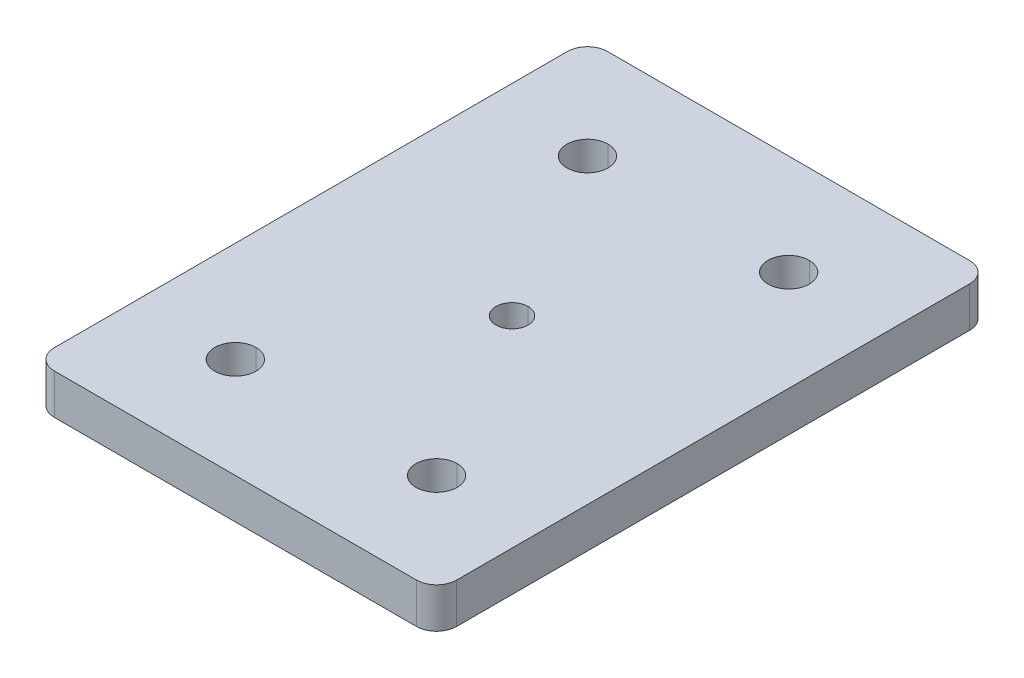
ISO-10303-21;
HEADER;
FILE_DESCRIPTION(('STEP AP214'),'2;1');
FILE_NAME('part.step','',(''),(''),'','','');
FILE_SCHEMA(('AUTOMOTIVE_DESIGN { 1 0 10303 214 1 1 1 1 }'));
ENDSEC;
DATA;
#1=APPLICATION_CONTEXT('core data for automotive mechanical design processes');
#2=APPLICATION_PROTOCOL_DEFINITION('international standard','automotive_design',2000,#1);
#3=PRODUCT_CONTEXT('',#1,'mechanical');
#4=PRODUCT('Part','Part','',(#3));
#5=PRODUCT_RELATED_PRODUCT_CATEGORY('part','',(#4));
#6=PRODUCT_DEFINITION_FORMATION('','',#4);
#7=PRODUCT_DEFINITION_CONTEXT('part definition',#1,'design');
#8=PRODUCT_DEFINITION('design','',#6,#7);
#9=PRODUCT_DEFINITION_SHAPE('','',#8);
#10=(LENGTH_UNIT() NAMED_UNIT(*) SI_UNIT(.MILLI.,.METRE.));
#11=(NAMED_UNIT(*) PLANE_ANGLE_UNIT() SI_UNIT($,.RADIAN.));
#12=(NAMED_UNIT(*) SI_UNIT($,.STERADIAN.) SOLID_ANGLE_UNIT());
#13=UNCERTAINTY_MEASURE_WITH_UNIT(LENGTH_MEASURE(1.E-05),#10,'distance_accuracy_value','');
#14=(GEOMETRIC_REPRESENTATION_CONTEXT(3) GLOBAL_UNCERTAINTY_ASSIGNED_CONTEXT((#13)) GLOBAL_UNIT_ASSIGNED_CONTEXT((#10,
#11,#12)) REPRESENTATION_CONTEXT('',''));
#15=CARTESIAN_POINT('',(0.,0.,0.));
#16=DIRECTION('',(0.,0.,1.));
#17=DIRECTION('',(1.,0.,0.));
#18=AXIS2_PLACEMENT_3D('',#15,#16,#17);
#19=CARTESIAN_POINT('',(18.,4.,25.5));
#20=DIRECTION('',(0.,-1.,0.));
#21=DIRECTION('',(0.,0.,-1.));
#22=AXIS2_PLACEMENT_3D('',#19,#20,#21);
#23=CYLINDRICAL_SURFACE('',#22,2.);
#24=CARTESIAN_POINT('',(18.,4.,25.5));
#25=DIRECTION('',(0.,1.,0.));
#26=DIRECTION('',(0.,0.,-1.));
#27=AXIS2_PLACEMENT_3D('',#24,#25,#26);
#28=CIRCLE('',#27,2.);
#29=CARTESIAN_POINT('',(18.,4.,27.5));
#30=VERTEX_POINT('',#29);
#31=CARTESIAN_POINT('',(20.,4.,25.5));
#32=VERTEX_POINT('',#31);
#33=EDGE_CURVE('E329',#30,#32,#28,.T.);
#34=ORIENTED_EDGE('',*,*,#33,.F.);
#35=DIRECTION('',(0.,1.,0.));
#36=VECTOR('',#35,1.);
#37=CARTESIAN_POINT('',(18.,4.,27.5));
#38=LINE('',#37,#36);
#39=CARTESIAN_POINT('',(18.,0.,27.5));
#40=VERTEX_POINT('',#39);
#41=EDGE_CURVE('E51',#40,#30,#38,.T.);
#42=ORIENTED_EDGE('',*,*,#41,.F.);
#43=CARTESIAN_POINT('',(18.,0.,25.5));
#44=DIRECTION('',(0.,-1.,0.));
#45=DIRECTION('',(0.,0.,-1.));
#46=AXIS2_PLACEMENT_3D('',#43,#44,#45);
#47=CIRCLE('',#46,2.);
#48=CARTESIAN_POINT('',(20.,0.,25.5));
#49=VERTEX_POINT('',#48);
#50=EDGE_CURVE('E300',#49,#40,#47,.T.);
#51=ORIENTED_EDGE('',*,*,#50,.F.);
#52=DIRECTION('',(0.,-1.,0.));
#53=VECTOR('',#52,1.);
#54=CARTESIAN_POINT('',(20.,4.,25.5));
#55=LINE('',#54,#53);
#56=EDGE_CURVE('E225',#32,#49,#55,.T.);
#57=ORIENTED_EDGE('',*,*,#56,.F.);
#58=EDGE_LOOP('',(#34,#42,#51,#57));
#59=FACE_BOUND('',#58,.T.);
#60=ADVANCED_FACE('F18',(#59),#23,.T.);
#61=CARTESIAN_POINT('',(-18.,4.,25.5));
#62=DIRECTION('',(0.,-1.,0.));
#63=DIRECTION('',(0.,0.,-1.));
#64=AXIS2_PLACEMENT_3D('',#61,#62,#63);
#65=CYLINDRICAL_SURFACE('',#64,2.);
#66=CARTESIAN_POINT('',(-18.,4.,25.5));
#67=DIRECTION('',(0.,1.,0.));
#68=DIRECTION('',(0.,0.,-1.));
#69=AXIS2_PLACEMENT_3D('',#66,#67,#68);
#70=CIRCLE('',#69,2.);
#71=CARTESIAN_POINT('',(-20.,4.,25.5));
#72=VERTEX_POINT('',#71);
#73=CARTESIAN_POINT('',(-18.,4.,27.5));
#74=VERTEX_POINT('',#73);
#75=EDGE_CURVE('E316',#72,#74,#70,.T.);
#76=ORIENTED_EDGE('',*,*,#75,.F.);
#77=DIRECTION('',(0.,1.,0.));
#78=VECTOR('',#77,1.);
#79=CARTESIAN_POINT('',(-20.,4.,25.5));
#80=LINE('',#79,#78);
#81=CARTESIAN_POINT('',(-20.,0.,25.5));
#82=VERTEX_POINT('',#81);
#83=EDGE_CURVE('E379',#82,#72,#80,.T.);
#84=ORIENTED_EDGE('',*,*,#83,.F.);
#85=CARTESIAN_POINT('',(-18.,0.,25.5));
#86=DIRECTION('',(0.,-1.,0.));
#87=DIRECTION('',(0.,0.,-1.));
#88=AXIS2_PLACEMENT_3D('',#85,#86,#87);
#89=CIRCLE('',#88,2.);
#90=CARTESIAN_POINT('',(-18.,0.,27.5));
#91=VERTEX_POINT('',#90);
#92=EDGE_CURVE('E321',#91,#82,#89,.T.);
#93=ORIENTED_EDGE('',*,*,#92,.F.);
#94=DIRECTION('',(0.,-1.,0.));
#95=VECTOR('',#94,1.);
#96=CARTESIAN_POINT('',(-18.,4.,27.5));
#97=LINE('',#96,#95);
#98=EDGE_CURVE('E40',#74,#91,#97,.T.);
#99=ORIENTED_EDGE('',*,*,#98,.F.);
#100=EDGE_LOOP('',(#76,#84,#93,#99));
#101=FACE_BOUND('',#100,.T.);
#102=ADVANCED_FACE('F20',(#101),#65,.T.);
#103=CARTESIAN_POINT('',(18.,4.,-25.5));
#104=DIRECTION('',(0.,-1.,0.));
#105=DIRECTION('',(0.,0.,-1.));
#106=AXIS2_PLACEMENT_3D('',#103,#104,#105);
#107=CYLINDRICAL_SURFACE('',#106,2.);
#108=CARTESIAN_POINT('',(18.,4.,-25.5));
#109=DIRECTION('',(0.,1.,0.));
#110=DIRECTION('',(0.,0.,-1.));
#111=AXIS2_PLACEMENT_3D('',#108,#109,#110);
#112=CIRCLE('',#111,2.);
#113=CARTESIAN_POINT('',(20.,4.,-25.5));
#114=VERTEX_POINT('',#113);
#115=CARTESIAN_POINT('',(18.,4.,-27.5));
#116=VERTEX_POINT('',#115);
#117=EDGE_CURVE('E337',#114,#116,#112,.T.);
#118=ORIENTED_EDGE('',*,*,#117,.F.);
#119=DIRECTION('',(0.,1.,0.));
#120=VECTOR('',#119,1.);
#121=CARTESIAN_POINT('',(20.,4.,-25.5));
#122=LINE('',#121,#120);
#123=CARTESIAN_POINT('',(20.,0.,-25.5));
#124=VERTEX_POINT('',#123);
#125=EDGE_CURVE('E223',#124,#114,#122,.T.);
#126=ORIENTED_EDGE('',*,*,#125,.F.);
#127=CARTESIAN_POINT('',(18.,0.,-25.5));
#128=DIRECTION('',(0.,-1.,0.));
#129=DIRECTION('',(0.,0.,-1.));
#130=AXIS2_PLACEMENT_3D('',#127,#128,#129);
#131=CIRCLE('',#130,2.);
#132=CARTESIAN_POINT('',(18.,0.,-27.5));
#133=VERTEX_POINT('',#132);
#134=EDGE_CURVE('E257',#133,#124,#131,.T.);
#135=ORIENTED_EDGE('',*,*,#134,.F.);
#136=DIRECTION('',(0.,-1.,0.));
#137=VECTOR('',#136,1.);
#138=CARTESIAN_POINT('',(18.,4.,-27.5));
#139=LINE('',#138,#137);
#140=EDGE_CURVE('E11',#116,#133,#139,.T.);
#141=ORIENTED_EDGE('',*,*,#140,.F.);
#142=EDGE_LOOP('',(#118,#126,#135,#141));
#143=FACE_BOUND('',#142,.T.);
#144=ADVANCED_FACE('F828',(#143),#107,.T.);
#145=CARTESIAN_POINT('',(-18.,4.,-25.5));
#146=DIRECTION('',(0.,-1.,0.));
#147=DIRECTION('',(0.,0.,-1.));
#148=AXIS2_PLACEMENT_3D('',#145,#146,#147);
#149=CYLINDRICAL_SURFACE('',#148,2.);
#150=CARTESIAN_POINT('',(-18.,4.,-25.5));
#151=DIRECTION('',(0.,1.,0.));
#152=DIRECTION('',(0.,0.,-1.));
#153=AXIS2_PLACEMENT_3D('',#150,#151,#152);
#154=CIRCLE('',#153,2.);
#155=CARTESIAN_POINT('',(-18.,4.,-27.5));
#156=VERTEX_POINT('',#155);
#157=CARTESIAN_POINT('',(-20.,4.,-25.5));
#158=VERTEX_POINT('',#157);
#159=EDGE_CURVE('E308',#156,#158,#154,.T.);
#160=ORIENTED_EDGE('',*,*,#159,.F.);
#161=DIRECTION('',(0.,1.,0.));
#162=VECTOR('',#161,1.);
#163=CARTESIAN_POINT('',(-18.,4.,-27.5));
#164=LINE('',#163,#162);
#165=CARTESIAN_POINT('',(-18.,0.,-27.5));
#166=VERTEX_POINT('',#165);
#167=EDGE_CURVE('E27',#166,#156,#164,.T.);
#168=ORIENTED_EDGE('',*,*,#167,.F.);
#169=CARTESIAN_POINT('',(-18.,0.,-25.5));
#170=DIRECTION('',(0.,-1.,0.));
#171=DIRECTION('',(0.,0.,-1.));
#172=AXIS2_PLACEMENT_3D('',#169,#170,#171);
#173=CIRCLE('',#172,2.);
#174=CARTESIAN_POINT('',(-20.,0.,-25.5));
#175=VERTEX_POINT('',#174);
#176=EDGE_CURVE('E355',#175,#166,#173,.T.);
#177=ORIENTED_EDGE('',*,*,#176,.F.);
#178=DIRECTION('',(0.,-1.,0.));
#179=VECTOR('',#178,1.);
#180=CARTESIAN_POINT('',(-20.,4.,-25.5));
#181=LINE('',#180,#179);
#182=EDGE_CURVE('E376',#158,#175,#181,.T.);
#183=ORIENTED_EDGE('',*,*,#182,.F.);
#184=EDGE_LOOP('',(#160,#168,#177,#183));
#185=FACE_BOUND('',#184,.T.);
#186=ADVANCED_FACE('F398',(#185),#149,.T.);
#187=CARTESIAN_POINT('',(-9.99999999999964,4.,17.5));
#188=DIRECTION('',(0.,-1.,0.));
#189=DIRECTION('',(0.,0.,-1.));
#190=AXIS2_PLACEMENT_3D('',#187,#188,#189);
#191=CYLINDRICAL_SURFACE('',#190,2.05);
#192=DIRECTION('',(0.,-1.,0.));
#193=VECTOR('',#192,1.);
#194=CARTESIAN_POINT('',(-9.99999999999964,4.,19.55));
#195=LINE('',#194,#193);
#196=CARTESIAN_POINT('',(-9.99999999999964,4.,19.55));
#197=VERTEX_POINT('',#196);
#198=CARTESIAN_POINT('',(-9.99999999999964,0.,19.55));
#199=VERTEX_POINT('',#198);
#200=EDGE_CURVE('E195',#197,#199,#195,.T.);
#201=ORIENTED_EDGE('',*,*,#200,.F.);
#202=CARTESIAN_POINT('',(-9.99999999999964,4.,17.5));
#203=DIRECTION('',(0.,1.,0.));
#204=DIRECTION('',(0.,0.,1.));
#205=AXIS2_PLACEMENT_3D('',#202,#203,#204);
#206=CIRCLE('',#205,2.05);
#207=CARTESIAN_POINT('',(-9.99999999999964,4.,15.45));
#208=VERTEX_POINT('',#207);
#209=EDGE_CURVE('E189',#197,#208,#206,.T.);
#210=ORIENTED_EDGE('',*,*,#209,.T.);
#211=DIRECTION('',(0.,-1.,0.));
#212=VECTOR('',#211,1.);
#213=CARTESIAN_POINT('',(-9.99999999999964,4.,15.45));
#214=LINE('',#213,#212);
#215=CARTESIAN_POINT('',(-9.99999999999964,0.,15.45));
#216=VERTEX_POINT('',#215);
#217=EDGE_CURVE('E192',#208,#216,#214,.T.);
#218=ORIENTED_EDGE('',*,*,#217,.T.);
#219=CARTESIAN_POINT('',(-9.99999999999964,0.,17.5));
#220=DIRECTION('',(0.,1.,0.));
#221=DIRECTION('',(0.,0.,1.));
#222=AXIS2_PLACEMENT_3D('',#219,#220,#221);
#223=CIRCLE('',#222,2.05);
#224=EDGE_CURVE('E373',#199,#216,#223,.T.);
#225=ORIENTED_EDGE('',*,*,#224,.F.);
#226=EDGE_LOOP('',(#201,#210,#218,#225));
#227=FACE_BOUND('',#226,.T.);
#228=ADVANCED_FACE('F191',(#227),#191,.F.);
#229=CARTESIAN_POINT('',(10.0000000000004,4.,17.5));
#230=DIRECTION('',(0.,-1.,0.));
#231=DIRECTION('',(0.,0.,-1.));
#232=AXIS2_PLACEMENT_3D('',#229,#230,#231);
#233=CYLINDRICAL_SURFACE('',#232,2.05);
#234=DIRECTION('',(0.,-1.,0.));
#235=VECTOR('',#234,1.);
#236=CARTESIAN_POINT('',(10.0000000000004,4.,19.55));
#237=LINE('',#236,#235);
#238=CARTESIAN_POINT('',(10.0000000000004,4.,19.55));
#239=VERTEX_POINT('',#238);
#240=CARTESIAN_POINT('',(10.0000000000004,0.,19.55));
#241=VERTEX_POINT('',#240);
#242=EDGE_CURVE('E244',#239,#241,#237,.T.);
#243=ORIENTED_EDGE('',*,*,#242,.F.);
#244=CARTESIAN_POINT('',(10.0000000000004,4.,17.5));
#245=DIRECTION('',(0.,1.,0.));
#246=DIRECTION('',(0.,0.,1.));
#247=AXIS2_PLACEMENT_3D('',#244,#245,#246);
#248=CIRCLE('',#247,2.05);
#249=CARTESIAN_POINT('',(10.0000000000004,4.,15.45));
#250=VERTEX_POINT('',#249);
#251=EDGE_CURVE('E201',#239,#250,#248,.T.);
#252=ORIENTED_EDGE('',*,*,#251,.T.);
#253=DIRECTION('',(0.,-1.,0.));
#254=VECTOR('',#253,1.);
#255=CARTESIAN_POINT('',(10.0000000000004,4.,15.45));
#256=LINE('',#255,#254);
#257=CARTESIAN_POINT('',(10.0000000000004,0.,15.45));
#258=VERTEX_POINT('',#257);
#259=EDGE_CURVE('E249',#250,#258,#256,.T.);
#260=ORIENTED_EDGE('',*,*,#259,.T.);
#261=CARTESIAN_POINT('',(10.0000000000004,0.,17.5));
#262=DIRECTION('',(0.,1.,0.));
#263=DIRECTION('',(0.,0.,1.));
#264=AXIS2_PLACEMENT_3D('',#261,#262,#263);
#265=CIRCLE('',#264,2.05);
#266=EDGE_CURVE('E325',#241,#258,#265,.T.);
#267=ORIENTED_EDGE('',*,*,#266,.F.);
#268=EDGE_LOOP('',(#243,#252,#260,#267));
#269=FACE_BOUND('',#268,.T.);
#270=ADVANCED_FACE('F739',(#269),#233,.F.);
#271=CARTESIAN_POINT('',(10.,4.,-17.5));
#272=DIRECTION('',(0.,-1.,0.));
#273=DIRECTION('',(0.,0.,-1.));
#274=AXIS2_PLACEMENT_3D('',#271,#272,#273);
#275=CYLINDRICAL_SURFACE('',#274,2.05);
#276=DIRECTION('',(0.,-1.,0.));
#277=VECTOR('',#276,1.);
#278=CARTESIAN_POINT('',(10.,4.,-15.45));
#279=LINE('',#278,#277);
#280=CARTESIAN_POINT('',(10.,4.,-15.45));
#281=VERTEX_POINT('',#280);
#282=CARTESIAN_POINT('',(10.,0.,-15.45));
#283=VERTEX_POINT('',#282);
#284=EDGE_CURVE('E266',#281,#283,#279,.T.);
#285=ORIENTED_EDGE('',*,*,#284,.F.);
#286=CARTESIAN_POINT('',(10.,4.,-17.5));
#287=DIRECTION('',(0.,1.,0.));
#288=DIRECTION('',(0.,0.,1.));
#289=AXIS2_PLACEMENT_3D('',#286,#287,#288);
#290=CIRCLE('',#289,2.05);
#291=CARTESIAN_POINT('',(10.,4.,-19.55));
#292=VERTEX_POINT('',#291);
#293=EDGE_CURVE('E347',#281,#292,#290,.T.);
#294=ORIENTED_EDGE('',*,*,#293,.T.);
#295=DIRECTION('',(0.,-1.,0.));
#296=VECTOR('',#295,1.);
#297=CARTESIAN_POINT('',(10.,4.,-19.55));
#298=LINE('',#297,#296);
#299=CARTESIAN_POINT('',(10.,0.,-19.55));
#300=VERTEX_POINT('',#299);
#301=EDGE_CURVE('E279',#292,#300,#298,.T.);
#302=ORIENTED_EDGE('',*,*,#301,.T.);
#303=CARTESIAN_POINT('',(10.,0.,-17.5));
#304=DIRECTION('',(0.,1.,0.));
#305=DIRECTION('',(0.,0.,1.));
#306=AXIS2_PLACEMENT_3D('',#303,#304,#305);
#307=CIRCLE('',#306,2.05);
#308=EDGE_CURVE('E289',#283,#300,#307,.T.);
#309=ORIENTED_EDGE('',*,*,#308,.F.);
#310=EDGE_LOOP('',(#285,#294,#302,#309));
#311=FACE_BOUND('',#310,.T.);
#312=ADVANCED_FACE('F707',(#311),#275,.F.);
#313=CARTESIAN_POINT('',(0.,4.,0.));
#314=DIRECTION('',(0.,-1.,0.));
#315=DIRECTION('',(0.,0.,-1.));
#316=AXIS2_PLACEMENT_3D('',#313,#314,#315);
#317=CYLINDRICAL_SURFACE('',#316,1.6);
#318=DIRECTION('',(0.,-1.,0.));
#319=VECTOR('',#318,1.);
#320=CARTESIAN_POINT('',(0.,4.,1.6));
#321=LINE('',#320,#319);
#322=CARTESIAN_POINT('',(0.,4.,1.6));
#323=VERTEX_POINT('',#322);
#324=CARTESIAN_POINT('',(0.,0.,1.6));
#325=VERTEX_POINT('',#324);
#326=EDGE_CURVE('E253',#323,#325,#321,.T.);
#327=ORIENTED_EDGE('',*,*,#326,.F.);
#328=CARTESIAN_POINT('',(0.,4.,0.));
#329=DIRECTION('',(0.,1.,0.));
#330=DIRECTION('',(0.,0.,1.));
#331=AXIS2_PLACEMENT_3D('',#328,#329,#330);
#332=CIRCLE('',#331,1.6);
#333=CARTESIAN_POINT('',(0.,4.,-1.6));
#334=VERTEX_POINT('',#333);
#335=EDGE_CURVE('E344',#323,#334,#332,.T.);
#336=ORIENTED_EDGE('',*,*,#335,.T.);
#337=DIRECTION('',(0.,-1.,0.));
#338=VECTOR('',#337,1.);
#339=CARTESIAN_POINT('',(0.,4.,-1.6));
#340=LINE('',#339,#338);
#341=CARTESIAN_POINT('',(0.,0.,-1.6));
#342=VERTEX_POINT('',#341);
#343=EDGE_CURVE('E229',#334,#342,#340,.T.);
#344=ORIENTED_EDGE('',*,*,#343,.T.);
#345=CARTESIAN_POINT('',(0.,0.,0.));
#346=DIRECTION('',(0.,1.,0.));
#347=DIRECTION('',(0.,0.,1.));
#348=AXIS2_PLACEMENT_3D('',#345,#346,#347);
#349=CIRCLE('',#348,1.6);
#350=EDGE_CURVE('E290',#325,#342,#349,.T.);
#351=ORIENTED_EDGE('',*,*,#350,.F.);
#352=EDGE_LOOP('',(#327,#336,#344,#351));
#353=FACE_BOUND('',#352,.T.);
#354=ADVANCED_FACE('F688',(#353),#317,.F.);
#355=CARTESIAN_POINT('',(-10.,4.,-17.5));
#356=DIRECTION('',(0.,-1.,0.));
#357=DIRECTION('',(0.,0.,-1.));
#358=AXIS2_PLACEMENT_3D('',#355,#356,#357);
#359=CYLINDRICAL_SURFACE('',#358,2.05);
#360=DIRECTION('',(0.,-1.,0.));
#361=VECTOR('',#360,1.);
#362=CARTESIAN_POINT('',(-10.,4.,-15.45));
#363=LINE('',#362,#361);
#364=CARTESIAN_POINT('',(-10.,4.,-15.45));
#365=VERTEX_POINT('',#364);
#366=CARTESIAN_POINT('',(-10.,0.,-15.45));
#367=VERTEX_POINT('',#366);
#368=EDGE_CURVE('E240',#365,#367,#363,.T.);
#369=ORIENTED_EDGE('',*,*,#368,.F.);
#370=CARTESIAN_POINT('',(-10.,4.,-17.5));
#371=DIRECTION('',(0.,1.,0.));
#372=DIRECTION('',(0.,0.,1.));
#373=AXIS2_PLACEMENT_3D('',#370,#371,#372);
#374=CIRCLE('',#373,2.05);
#375=CARTESIAN_POINT('',(-10.,4.,-19.55));
#376=VERTEX_POINT('',#375);
#377=EDGE_CURVE('E341',#365,#376,#374,.T.);
#378=ORIENTED_EDGE('',*,*,#377,.T.);
#379=DIRECTION('',(0.,-1.,0.));
#380=VECTOR('',#379,1.);
#381=CARTESIAN_POINT('',(-10.,4.,-19.55));
#382=LINE('',#381,#380);
#383=CARTESIAN_POINT('',(-10.,0.,-19.55));
#384=VERTEX_POINT('',#383);
#385=EDGE_CURVE('E239',#376,#384,#382,.T.);
#386=ORIENTED_EDGE('',*,*,#385,.T.);
#387=CARTESIAN_POINT('',(-10.,0.,-17.5));
#388=DIRECTION('',(0.,1.,0.));
#389=DIRECTION('',(0.,0.,1.));
#390=AXIS2_PLACEMENT_3D('',#387,#388,#389);
#391=CIRCLE('',#390,2.05);
#392=EDGE_CURVE('E286',#367,#384,#391,.T.);
#393=ORIENTED_EDGE('',*,*,#392,.F.);
#394=EDGE_LOOP('',(#369,#378,#386,#393));
#395=FACE_BOUND('',#394,.T.);
#396=ADVANCED_FACE('F684',(#395),#359,.F.);
#397=CARTESIAN_POINT('',(20.,4.,-27.5));
#398=DIRECTION('',(0.,0.,1.));
#399=DIRECTION('',(1.,0.,0.));
#400=AXIS2_PLACEMENT_3D('',#397,#398,#399);
#401=PLANE('',#400);
#402=DIRECTION('',(-1.,0.,0.));
#403=VECTOR('',#402,1.);
#404=CARTESIAN_POINT('',(20.,0.,-27.5));
#405=LINE('',#404,#403);
#406=EDGE_CURVE('E262',#133,#166,#405,.T.);
#407=ORIENTED_EDGE('',*,*,#406,.T.);
#408=ORIENTED_EDGE('',*,*,#167,.T.);
#409=DIRECTION('',(-1.,0.,0.));
#410=VECTOR('',#409,1.);
#411=CARTESIAN_POINT('',(20.,4.,-27.5));
#412=LINE('',#411,#410);
#413=EDGE_CURVE('E222',#116,#156,#412,.T.);
#414=ORIENTED_EDGE('',*,*,#413,.F.);
#415=ORIENTED_EDGE('',*,*,#140,.T.);
#416=EDGE_LOOP('',(#407,#408,#414,#415));
#417=FACE_BOUND('',#416,.T.);
#418=ADVANCED_FACE('F393',(#417),#401,.F.);
#419=CARTESIAN_POINT('',(20.,4.,-27.5));
#420=DIRECTION('',(-1.,0.,0.));
#421=DIRECTION('',(0.,1.,0.));
#422=AXIS2_PLACEMENT_3D('',#419,#420,#421);
#423=PLANE('',#422);
#424=DIRECTION('',(0.,0.,-1.));
#425=VECTOR('',#424,1.);
#426=CARTESIAN_POINT('',(20.,0.,-27.5));
#427=LINE('',#426,#425);
#428=EDGE_CURVE('E261',#49,#124,#427,.T.);
#429=ORIENTED_EDGE('',*,*,#428,.T.);
#430=ORIENTED_EDGE('',*,*,#125,.T.);
#431=DIRECTION('',(0.,0.,-1.));
#432=VECTOR('',#431,1.);
#433=CARTESIAN_POINT('',(20.,4.,-27.5));
#434=LINE('',#433,#432);
#435=EDGE_CURVE('E333',#32,#114,#434,.T.);
#436=ORIENTED_EDGE('',*,*,#435,.F.);
#437=ORIENTED_EDGE('',*,*,#56,.T.);
#438=EDGE_LOOP('',(#429,#430,#436,#437));
#439=FACE_BOUND('',#438,.T.);
#440=ADVANCED_FACE('F722',(#439),#423,.F.);
#441=CARTESIAN_POINT('',(20.,4.,27.5));
#442=DIRECTION('',(0.,0.,-1.));
#443=DIRECTION('',(0.,-1.,0.));
#444=AXIS2_PLACEMENT_3D('',#441,#442,#443);
#445=PLANE('',#444);
#446=DIRECTION('',(1.,0.,0.));
#447=VECTOR('',#446,1.);
#448=CARTESIAN_POINT('',(20.,4.,27.5));
#449=LINE('',#448,#447);
#450=EDGE_CURVE('E320',#74,#30,#449,.T.);
#451=ORIENTED_EDGE('',*,*,#450,.F.);
#452=ORIENTED_EDGE('',*,*,#98,.T.);
#453=DIRECTION('',(1.,0.,0.));
#454=VECTOR('',#453,1.);
#455=CARTESIAN_POINT('',(20.,0.,27.5));
#456=LINE('',#455,#454);
#457=EDGE_CURVE('E304',#91,#40,#456,.T.);
#458=ORIENTED_EDGE('',*,*,#457,.T.);
#459=ORIENTED_EDGE('',*,*,#41,.T.);
#460=EDGE_LOOP('',(#451,#452,#458,#459));
#461=FACE_BOUND('',#460,.T.);
#462=ADVANCED_FACE('F717',(#461),#445,.F.);
#463=CARTESIAN_POINT('',(-20.,4.,-27.5));
#464=DIRECTION('',(1.,0.,0.));
#465=DIRECTION('',(0.,0.,-1.));
#466=AXIS2_PLACEMENT_3D('',#463,#464,#465);
#467=PLANE('',#466);
#468=DIRECTION('',(0.,0.,1.));
#469=VECTOR('',#468,1.);
#470=CARTESIAN_POINT('',(-20.,4.,-27.5));
#471=LINE('',#470,#469);
#472=EDGE_CURVE('E312',#158,#72,#471,.T.);
#473=ORIENTED_EDGE('',*,*,#472,.F.);
#474=ORIENTED_EDGE('',*,*,#182,.T.);
#475=DIRECTION('',(0.,0.,1.));
#476=VECTOR('',#475,1.);
#477=CARTESIAN_POINT('',(-20.,0.,-27.5));
#478=LINE('',#477,#476);
#479=EDGE_CURVE('E200',#175,#82,#478,.T.);
#480=ORIENTED_EDGE('',*,*,#479,.T.);
#481=ORIENTED_EDGE('',*,*,#83,.T.);
#482=EDGE_LOOP('',(#473,#474,#480,#481));
#483=FACE_BOUND('',#482,.T.);
#484=ADVANCED_FACE('F721',(#483),#467,.F.);
#485=CARTESIAN_POINT('',(0.,0.,0.));
#486=DIRECTION('',(0.,-1.,0.));
#487=DIRECTION('',(0.,0.,-1.));
#488=AXIS2_PLACEMENT_3D('',#485,#486,#487);
#489=PLANE('',#488);
#490=CARTESIAN_POINT('',(-9.99999999999964,0.,17.5));
#491=DIRECTION('',(0.,1.,0.));
#492=DIRECTION('',(0.,0.,1.));
#493=AXIS2_PLACEMENT_3D('',#490,#491,#492);
#494=CIRCLE('',#493,2.05);
#495=EDGE_CURVE('E207',#216,#199,#494,.T.);
#496=ORIENTED_EDGE('',*,*,#495,.T.);
#497=ORIENTED_EDGE('',*,*,#224,.T.);
#498=EDGE_LOOP('',(#496,#497));
#499=FACE_BOUND('',#498,.T.);
#500=CARTESIAN_POINT('',(10.,0.,-17.5));
#501=DIRECTION('',(0.,1.,0.));
#502=DIRECTION('',(0.,0.,1.));
#503=AXIS2_PLACEMENT_3D('',#500,#501,#502);
#504=CIRCLE('',#503,2.05);
#505=EDGE_CURVE('E270',#300,#283,#504,.T.);
#506=ORIENTED_EDGE('',*,*,#505,.T.);
#507=ORIENTED_EDGE('',*,*,#308,.T.);
#508=EDGE_LOOP('',(#506,#507));
#509=FACE_BOUND('',#508,.T.);
#510=CARTESIAN_POINT('',(-10.,0.,-17.5));
#511=DIRECTION('',(0.,1.,0.));
#512=DIRECTION('',(0.,0.,1.));
#513=AXIS2_PLACEMENT_3D('',#510,#511,#512);
#514=CIRCLE('',#513,2.05);
#515=EDGE_CURVE('E235',#384,#367,#514,.T.);
#516=ORIENTED_EDGE('',*,*,#515,.T.);
#517=ORIENTED_EDGE('',*,*,#392,.T.);
#518=EDGE_LOOP('',(#516,#517));
#519=FACE_BOUND('',#518,.T.);
#520=CARTESIAN_POINT('',(0.,0.,0.));
#521=DIRECTION('',(0.,1.,0.));
#522=DIRECTION('',(0.,0.,1.));
#523=AXIS2_PLACEMENT_3D('',#520,#521,#522);
#524=CIRCLE('',#523,1.6);
#525=EDGE_CURVE('E233',#342,#325,#524,.T.);
#526=ORIENTED_EDGE('',*,*,#525,.T.);
#527=ORIENTED_EDGE('',*,*,#350,.T.);
#528=EDGE_LOOP('',(#526,#527));
#529=FACE_BOUND('',#528,.T.);
#530=CARTESIAN_POINT('',(10.0000000000004,0.,17.5));
#531=DIRECTION('',(0.,1.,0.));
#532=DIRECTION('',(0.,0.,1.));
#533=AXIS2_PLACEMENT_3D('',#530,#531,#532);
#534=CIRCLE('',#533,2.05);
#535=EDGE_CURVE('E245',#258,#241,#534,.T.);
#536=ORIENTED_EDGE('',*,*,#535,.T.);
#537=ORIENTED_EDGE('',*,*,#266,.T.);
#538=EDGE_LOOP('',(#536,#537));
#539=FACE_BOUND('',#538,.T.);
#540=ORIENTED_EDGE('',*,*,#479,.F.);
#541=ORIENTED_EDGE('',*,*,#176,.T.);
#542=ORIENTED_EDGE('',*,*,#406,.F.);
#543=ORIENTED_EDGE('',*,*,#134,.T.);
#544=ORIENTED_EDGE('',*,*,#428,.F.);
#545=ORIENTED_EDGE('',*,*,#50,.T.);
#546=ORIENTED_EDGE('',*,*,#457,.F.);
#547=ORIENTED_EDGE('',*,*,#92,.T.);
#548=EDGE_LOOP('',(#540,#541,#542,#543,#544,#545,#546,#547));
#549=FACE_BOUND('',#548,.T.);
#550=ADVANCED_FACE('F767',(#499,#509,#519,#529,#539,#549),#489,.T.);
#551=CARTESIAN_POINT('',(0.,4.,0.));
#552=DIRECTION('',(0.,-1.,0.));
#553=DIRECTION('',(0.,0.,-1.));
#554=AXIS2_PLACEMENT_3D('',#551,#552,#553);
#555=PLANE('',#554);
#556=CARTESIAN_POINT('',(-9.99999999999964,4.,17.5));
#557=DIRECTION('',(0.,1.,0.));
#558=DIRECTION('',(0.,0.,1.));
#559=AXIS2_PLACEMENT_3D('',#556,#557,#558);
#560=CIRCLE('',#559,2.05);
#561=EDGE_CURVE('E205',#208,#197,#560,.T.);
#562=ORIENTED_EDGE('',*,*,#561,.F.);
#563=ORIENTED_EDGE('',*,*,#209,.F.);
#564=EDGE_LOOP('',(#562,#563));
#565=FACE_BOUND('',#564,.T.);
#566=CARTESIAN_POINT('',(10.0000000000004,4.,17.5));
#567=DIRECTION('',(0.,1.,0.));
#568=DIRECTION('',(0.,0.,1.));
#569=AXIS2_PLACEMENT_3D('',#566,#567,#568);
#570=CIRCLE('',#569,2.05);
#571=EDGE_CURVE('E209',#250,#239,#570,.T.);
#572=ORIENTED_EDGE('',*,*,#571,.F.);
#573=ORIENTED_EDGE('',*,*,#251,.F.);
#574=EDGE_LOOP('',(#572,#573));
#575=FACE_BOUND('',#574,.T.);
#576=CARTESIAN_POINT('',(10.,4.,-17.5));
#577=DIRECTION('',(0.,1.,0.));
#578=DIRECTION('',(0.,0.,1.));
#579=AXIS2_PLACEMENT_3D('',#576,#577,#578);
#580=CIRCLE('',#579,2.05);
#581=EDGE_CURVE('E271',#292,#281,#580,.T.);
#582=ORIENTED_EDGE('',*,*,#581,.F.);
#583=ORIENTED_EDGE('',*,*,#293,.F.);
#584=EDGE_LOOP('',(#582,#583));
#585=FACE_BOUND('',#584,.T.);
#586=CARTESIAN_POINT('',(0.,4.,0.));
#587=DIRECTION('',(0.,1.,0.));
#588=DIRECTION('',(0.,0.,1.));
#589=AXIS2_PLACEMENT_3D('',#586,#587,#588);
#590=CIRCLE('',#589,1.6);
#591=EDGE_CURVE('E275',#334,#323,#590,.T.);
#592=ORIENTED_EDGE('',*,*,#591,.F.);
#593=ORIENTED_EDGE('',*,*,#335,.F.);
#594=EDGE_LOOP('',(#592,#593));
#595=FACE_BOUND('',#594,.T.);
#596=CARTESIAN_POINT('',(-10.,4.,-17.5));
#597=DIRECTION('',(0.,1.,0.));
#598=DIRECTION('',(0.,0.,1.));
#599=AXIS2_PLACEMENT_3D('',#596,#597,#598);
#600=CIRCLE('',#599,2.05);
#601=EDGE_CURVE('E232',#376,#365,#600,.T.);
#602=ORIENTED_EDGE('',*,*,#601,.F.);
#603=ORIENTED_EDGE('',*,*,#377,.F.);
#604=EDGE_LOOP('',(#602,#603));
#605=FACE_BOUND('',#604,.T.);
#606=ORIENTED_EDGE('',*,*,#413,.T.);
#607=ORIENTED_EDGE('',*,*,#159,.T.);
#608=ORIENTED_EDGE('',*,*,#472,.T.);
#609=ORIENTED_EDGE('',*,*,#75,.T.);
#610=ORIENTED_EDGE('',*,*,#450,.T.);
#611=ORIENTED_EDGE('',*,*,#33,.T.);
#612=ORIENTED_EDGE('',*,*,#435,.T.);
#613=ORIENTED_EDGE('',*,*,#117,.T.);
#614=EDGE_LOOP('',(#606,#607,#608,#609,#610,#611,#612,#613));
#615=FACE_BOUND('',#614,.T.);
#616=ADVANCED_FACE('F211',(#565,#575,#585,#595,#605,#615),#555,.F.);
#617=CARTESIAN_POINT('',(-10.,4.,-17.5));
#618=DIRECTION('',(0.,-1.,0.));
#619=DIRECTION('',(0.,0.,-1.));
#620=AXIS2_PLACEMENT_3D('',#617,#618,#619);
#621=CYLINDRICAL_SURFACE('',#620,2.05);
#622=ORIENTED_EDGE('',*,*,#601,.T.);
#623=ORIENTED_EDGE('',*,*,#368,.T.);
#624=ORIENTED_EDGE('',*,*,#515,.F.);
#625=ORIENTED_EDGE('',*,*,#385,.F.);
#626=EDGE_LOOP('',(#622,#623,#624,#625));
#627=FACE_BOUND('',#626,.T.);
#628=ADVANCED_FACE('F748',(#627),#621,.F.);
#629=CARTESIAN_POINT('',(0.,4.,0.));
#630=DIRECTION('',(0.,-1.,0.));
#631=DIRECTION('',(0.,0.,-1.));
#632=AXIS2_PLACEMENT_3D('',#629,#630,#631);
#633=CYLINDRICAL_SURFACE('',#632,1.6);
#634=ORIENTED_EDGE('',*,*,#591,.T.);
#635=ORIENTED_EDGE('',*,*,#326,.T.);
#636=ORIENTED_EDGE('',*,*,#525,.F.);
#637=ORIENTED_EDGE('',*,*,#343,.F.);
#638=EDGE_LOOP('',(#634,#635,#636,#637));
#639=FACE_BOUND('',#638,.T.);
#640=ADVANCED_FACE('F730',(#639),#633,.F.);
#641=CARTESIAN_POINT('',(10.,4.,-17.5));
#642=DIRECTION('',(0.,-1.,0.));
#643=DIRECTION('',(0.,0.,-1.));
#644=AXIS2_PLACEMENT_3D('',#641,#642,#643);
#645=CYLINDRICAL_SURFACE('',#644,2.05);
#646=ORIENTED_EDGE('',*,*,#581,.T.);
#647=ORIENTED_EDGE('',*,*,#284,.T.);
#648=ORIENTED_EDGE('',*,*,#505,.F.);
#649=ORIENTED_EDGE('',*,*,#301,.F.);
#650=EDGE_LOOP('',(#646,#647,#648,#649));
#651=FACE_BOUND('',#650,.T.);
#652=ADVANCED_FACE('F697',(#651),#645,.F.);
#653=CARTESIAN_POINT('',(10.0000000000004,4.,17.5));
#654=DIRECTION('',(0.,-1.,0.));
#655=DIRECTION('',(0.,0.,-1.));
#656=AXIS2_PLACEMENT_3D('',#653,#654,#655);
#657=CYLINDRICAL_SURFACE('',#656,2.05);
#658=ORIENTED_EDGE('',*,*,#571,.T.);
#659=ORIENTED_EDGE('',*,*,#242,.T.);
#660=ORIENTED_EDGE('',*,*,#535,.F.);
#661=ORIENTED_EDGE('',*,*,#259,.F.);
#662=EDGE_LOOP('',(#658,#659,#660,#661));
#663=FACE_BOUND('',#662,.T.);
#664=ADVANCED_FACE('F679',(#663),#657,.F.);
#665=CARTESIAN_POINT('',(-9.99999999999964,4.,17.5));
#666=DIRECTION('',(0.,-1.,0.));
#667=DIRECTION('',(0.,0.,-1.));
#668=AXIS2_PLACEMENT_3D('',#665,#666,#667);
#669=CYLINDRICAL_SURFACE('',#668,2.05);
#670=ORIENTED_EDGE('',*,*,#561,.T.);
#671=ORIENTED_EDGE('',*,*,#200,.T.);
#672=ORIENTED_EDGE('',*,*,#495,.F.);
#673=ORIENTED_EDGE('',*,*,#217,.F.);
#674=EDGE_LOOP('',(#670,#671,#672,#673));
#675=FACE_BOUND('',#674,.T.);
#676=ADVANCED_FACE('F204',(#675),#669,.F.);
#677=CLOSED_SHELL('',(#60,#102,#144,#186,#228,#270,#312,#354,#396,#418,#440,#462,#484,#550,#616,
#628,#640,#652,#664,#676));
#678=MANIFOLD_SOLID_BREP('B1',#677);
#679=ADVANCED_BREP_SHAPE_REPRESENTATION('',(#18,#678),#14);
#680=SHAPE_DEFINITION_REPRESENTATION(#9,#679);
ENDSEC;
END-ISO-10303-21;
